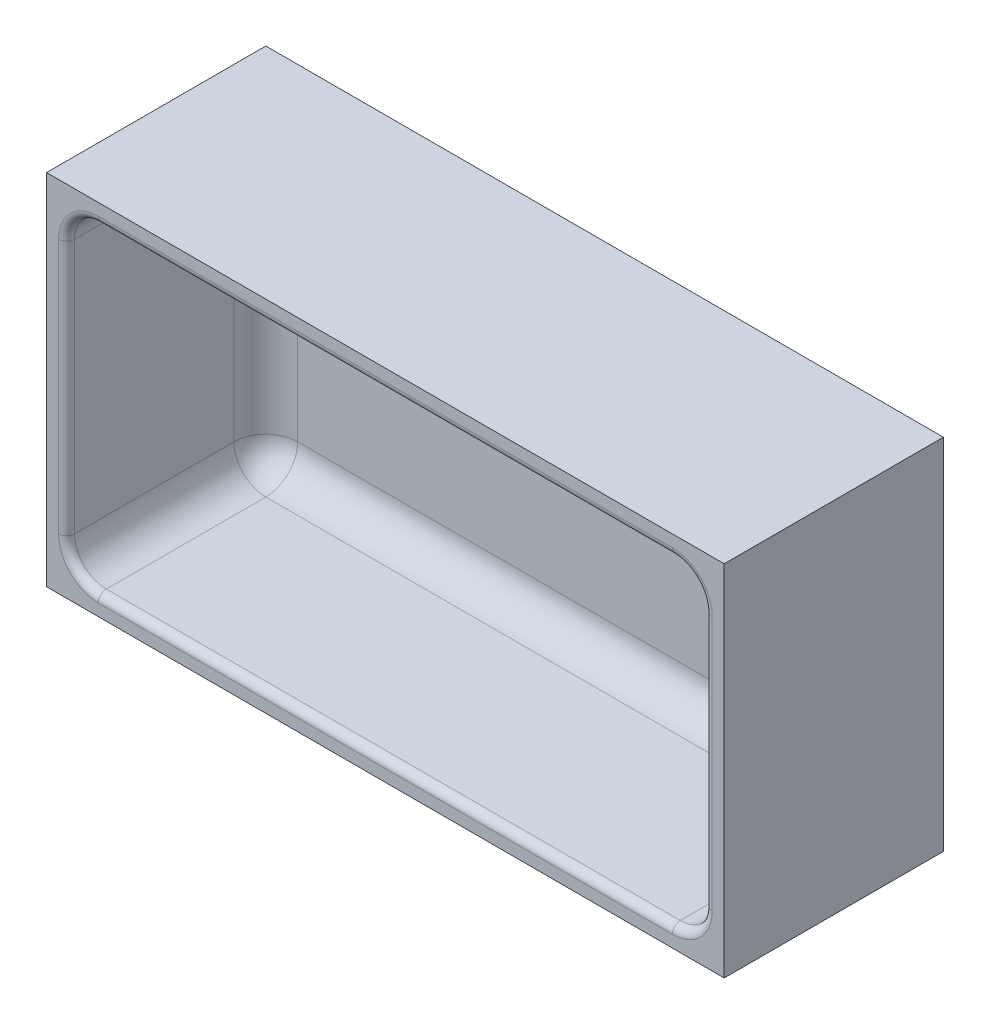
ISO-10303-21;
HEADER;
FILE_DESCRIPTION(('STEP AP214'),'2;1');
FILE_NAME('part.step','',(''),(''),'','','');
FILE_SCHEMA(('AUTOMOTIVE_DESIGN { 1 0 10303 214 1 1 1 1 }'));
ENDSEC;
DATA;
#1=APPLICATION_CONTEXT('core data for automotive mechanical design processes');
#2=APPLICATION_PROTOCOL_DEFINITION('international standard','automotive_design',2000,#1);
#3=PRODUCT_CONTEXT('',#1,'mechanical');
#4=PRODUCT('Part','Part','',(#3));
#5=PRODUCT_RELATED_PRODUCT_CATEGORY('part','',(#4));
#6=PRODUCT_DEFINITION_FORMATION('','',#4);
#7=PRODUCT_DEFINITION_CONTEXT('part definition',#1,'design');
#8=PRODUCT_DEFINITION('design','',#6,#7);
#9=PRODUCT_DEFINITION_SHAPE('','',#8);
#10=(LENGTH_UNIT() NAMED_UNIT(*) SI_UNIT(.MILLI.,.METRE.));
#11=(NAMED_UNIT(*) PLANE_ANGLE_UNIT() SI_UNIT($,.RADIAN.));
#12=(NAMED_UNIT(*) SI_UNIT($,.STERADIAN.) SOLID_ANGLE_UNIT());
#13=UNCERTAINTY_MEASURE_WITH_UNIT(LENGTH_MEASURE(1.E-05),#10,'distance_accuracy_value','');
#14=(GEOMETRIC_REPRESENTATION_CONTEXT(3) GLOBAL_UNCERTAINTY_ASSIGNED_CONTEXT((#13)) GLOBAL_UNIT_ASSIGNED_CONTEXT((#10,
#11,#12)) REPRESENTATION_CONTEXT('',''));
#15=CARTESIAN_POINT('',(0.,0.,0.));
#16=DIRECTION('',(0.,0.,1.));
#17=DIRECTION('',(1.,0.,0.));
#18=AXIS2_PLACEMENT_3D('',#15,#16,#17);
#19=CARTESIAN_POINT('',(0.,0.,5.));
#20=DIRECTION('',(0.,0.,-1.));
#21=DIRECTION('',(-1.,0.,0.));
#22=AXIS2_PLACEMENT_3D('',#19,#20,#21);
#23=PLANE('',#22);
#24=DIRECTION('',(-1.,0.,0.));
#25=VECTOR('',#24,1.);
#26=CARTESIAN_POINT('',(0.,13.,5.));
#27=LINE('',#26,#25);
#28=CARTESIAN_POINT('',(-157.,13.,5.));
#29=VERTEX_POINT('',#28);
#30=CARTESIAN_POINT('',(-13.,13.,5.));
#31=VERTEX_POINT('',#30);
#32=EDGE_CURVE('E225',#29,#31,#27,.F.);
#33=ORIENTED_EDGE('',*,*,#32,.T.);
#34=DIRECTION('',(0.,1.,0.));
#35=VECTOR('',#34,1.);
#36=CARTESIAN_POINT('',(-13.,0.,5.));
#37=LINE('',#36,#35);
#38=CARTESIAN_POINT('',(-13.,77.,5.));
#39=VERTEX_POINT('',#38);
#40=EDGE_CURVE('E227',#31,#39,#37,.T.);
#41=ORIENTED_EDGE('',*,*,#40,.T.);
#42=DIRECTION('',(1.,0.,0.));
#43=VECTOR('',#42,1.);
#44=CARTESIAN_POINT('',(0.,77.,5.));
#45=LINE('',#44,#43);
#46=CARTESIAN_POINT('',(-157.,77.,5.));
#47=VERTEX_POINT('',#46);
#48=EDGE_CURVE('E223',#39,#47,#45,.F.);
#49=ORIENTED_EDGE('',*,*,#48,.T.);
#50=DIRECTION('',(0.,1.,0.));
#51=VECTOR('',#50,1.);
#52=CARTESIAN_POINT('',(-157.,0.,5.));
#53=LINE('',#52,#51);
#54=EDGE_CURVE('E221',#47,#29,#53,.F.);
#55=ORIENTED_EDGE('',*,*,#54,.T.);
#56=EDGE_LOOP('',(#33,#41,#49,#55));
#57=FACE_BOUND('',#56,.T.);
#58=ADVANCED_FACE('F39',(#57),#23,.F.);
#59=CARTESIAN_POINT('',(-5.,5.,55.));
#60=DIRECTION('',(-1.,0.,0.));
#61=DIRECTION('',(0.,0.,1.));
#62=AXIS2_PLACEMENT_3D('',#59,#60,#61);
#63=PLANE('',#62);
#64=DIRECTION('',(0.,0.,-1.));
#65=VECTOR('',#64,1.);
#66=CARTESIAN_POINT('',(-5.,13.,55.));
#67=LINE('',#66,#65);
#68=CARTESIAN_POINT('',(-5.,13.,13.));
#69=VERTEX_POINT('',#68);
#70=CARTESIAN_POINT('',(-5.,13.,53.));
#71=VERTEX_POINT('',#70);
#72=EDGE_CURVE('E205',#69,#71,#67,.F.);
#73=ORIENTED_EDGE('',*,*,#72,.T.);
#74=DIRECTION('',(0.,1.,0.));
#75=VECTOR('',#74,1.);
#76=CARTESIAN_POINT('',(-5.,77.,53.));
#77=LINE('',#76,#75);
#78=CARTESIAN_POINT('',(-5.,77.,53.));
#79=VERTEX_POINT('',#78);
#80=EDGE_CURVE('E289',#71,#79,#77,.T.);
#81=ORIENTED_EDGE('',*,*,#80,.T.);
#82=DIRECTION('',(0.,0.,-1.));
#83=VECTOR('',#82,1.);
#84=CARTESIAN_POINT('',(-5.,77.,5.));
#85=LINE('',#84,#83);
#86=CARTESIAN_POINT('',(-5.,77.,13.));
#87=VERTEX_POINT('',#86);
#88=EDGE_CURVE('E203',#79,#87,#85,.T.);
#89=ORIENTED_EDGE('',*,*,#88,.T.);
#90=DIRECTION('',(0.,1.,0.));
#91=VECTOR('',#90,1.);
#92=CARTESIAN_POINT('',(-5.,5.,13.));
#93=LINE('',#92,#91);
#94=EDGE_CURVE('E201',#87,#69,#93,.F.);
#95=ORIENTED_EDGE('',*,*,#94,.T.);
#96=EDGE_LOOP('',(#73,#81,#89,#95));
#97=FACE_BOUND('',#96,.T.);
#98=ADVANCED_FACE('F333',(#97),#63,.T.);
#99=CARTESIAN_POINT('',(-165.,85.,55.));
#100=DIRECTION('',(0.,-1.,0.));
#101=DIRECTION('',(0.,0.,-1.));
#102=AXIS2_PLACEMENT_3D('',#99,#100,#101);
#103=PLANE('',#102);
#104=DIRECTION('',(0.,0.,-1.));
#105=VECTOR('',#104,1.);
#106=CARTESIAN_POINT('',(-13.,85.,55.));
#107=LINE('',#106,#105);
#108=CARTESIAN_POINT('',(-13.,85.,13.));
#109=VERTEX_POINT('',#108);
#110=CARTESIAN_POINT('',(-13.,85.,53.));
#111=VERTEX_POINT('',#110);
#112=EDGE_CURVE('E212',#109,#111,#107,.F.);
#113=ORIENTED_EDGE('',*,*,#112,.T.);
#114=DIRECTION('',(-1.,0.,0.));
#115=VECTOR('',#114,1.);
#116=CARTESIAN_POINT('',(-157.,85.,53.));
#117=LINE('',#116,#115);
#118=CARTESIAN_POINT('',(-157.,85.,53.));
#119=VERTEX_POINT('',#118);
#120=EDGE_CURVE('E285',#111,#119,#117,.T.);
#121=ORIENTED_EDGE('',*,*,#120,.T.);
#122=DIRECTION('',(0.,0.,-1.));
#123=VECTOR('',#122,1.);
#124=CARTESIAN_POINT('',(-157.,85.,5.));
#125=LINE('',#124,#123);
#126=CARTESIAN_POINT('',(-157.,85.,13.));
#127=VERTEX_POINT('',#126);
#128=EDGE_CURVE('E210',#119,#127,#125,.T.);
#129=ORIENTED_EDGE('',*,*,#128,.T.);
#130=DIRECTION('',(1.,0.,0.));
#131=VECTOR('',#130,1.);
#132=CARTESIAN_POINT('',(-165.,85.,13.));
#133=LINE('',#132,#131);
#134=EDGE_CURVE('E208',#127,#109,#133,.T.);
#135=ORIENTED_EDGE('',*,*,#134,.T.);
#136=EDGE_LOOP('',(#113,#121,#129,#135));
#137=FACE_BOUND('',#136,.T.);
#138=ADVANCED_FACE('F378',(#137),#103,.T.);
#139=CARTESIAN_POINT('',(-165.,5.,55.));
#140=DIRECTION('',(1.,0.,0.));
#141=DIRECTION('',(0.,0.,-1.));
#142=AXIS2_PLACEMENT_3D('',#139,#140,#141);
#143=PLANE('',#142);
#144=DIRECTION('',(0.,0.,-1.));
#145=VECTOR('',#144,1.);
#146=CARTESIAN_POINT('',(-165.,77.,55.));
#147=LINE('',#146,#145);
#148=CARTESIAN_POINT('',(-165.,77.,13.));
#149=VERTEX_POINT('',#148);
#150=CARTESIAN_POINT('',(-165.,77.,53.));
#151=VERTEX_POINT('',#150);
#152=EDGE_CURVE('E219',#149,#151,#147,.F.);
#153=ORIENTED_EDGE('',*,*,#152,.T.);
#154=DIRECTION('',(0.,-1.,0.));
#155=VECTOR('',#154,1.);
#156=CARTESIAN_POINT('',(-165.,13.,53.));
#157=LINE('',#156,#155);
#158=CARTESIAN_POINT('',(-165.,13.,53.));
#159=VERTEX_POINT('',#158);
#160=EDGE_CURVE('E11',#151,#159,#157,.T.);
#161=ORIENTED_EDGE('',*,*,#160,.T.);
#162=DIRECTION('',(0.,0.,-1.));
#163=VECTOR('',#162,1.);
#164=CARTESIAN_POINT('',(-165.,13.,5.));
#165=LINE('',#164,#163);
#166=CARTESIAN_POINT('',(-165.,13.,13.));
#167=VERTEX_POINT('',#166);
#168=EDGE_CURVE('E217',#159,#167,#165,.T.);
#169=ORIENTED_EDGE('',*,*,#168,.T.);
#170=DIRECTION('',(0.,1.,0.));
#171=VECTOR('',#170,1.);
#172=CARTESIAN_POINT('',(-165.,5.,13.));
#173=LINE('',#172,#171);
#174=EDGE_CURVE('E215',#167,#149,#173,.T.);
#175=ORIENTED_EDGE('',*,*,#174,.T.);
#176=EDGE_LOOP('',(#153,#161,#169,#175));
#177=FACE_BOUND('',#176,.T.);
#178=ADVANCED_FACE('F362',(#177),#143,.T.);
#179=CARTESIAN_POINT('',(-5.,5.,55.));
#180=DIRECTION('',(0.,1.,0.));
#181=DIRECTION('',(0.,0.,1.));
#182=AXIS2_PLACEMENT_3D('',#179,#180,#181);
#183=PLANE('',#182);
#184=DIRECTION('',(0.,0.,-1.));
#185=VECTOR('',#184,1.);
#186=CARTESIAN_POINT('',(-157.,5.,55.));
#187=LINE('',#186,#185);
#188=CARTESIAN_POINT('',(-157.,5.,13.));
#189=VERTEX_POINT('',#188);
#190=CARTESIAN_POINT('',(-157.,5.,53.));
#191=VERTEX_POINT('',#190);
#192=EDGE_CURVE('E192',#189,#191,#187,.F.);
#193=ORIENTED_EDGE('',*,*,#192,.T.);
#194=DIRECTION('',(1.,0.,0.));
#195=VECTOR('',#194,1.);
#196=CARTESIAN_POINT('',(-13.,5.,53.));
#197=LINE('',#196,#195);
#198=CARTESIAN_POINT('',(-13.,5.,53.));
#199=VERTEX_POINT('',#198);
#200=EDGE_CURVE('E293',#191,#199,#197,.T.);
#201=ORIENTED_EDGE('',*,*,#200,.T.);
#202=DIRECTION('',(0.,0.,-1.));
#203=VECTOR('',#202,1.);
#204=CARTESIAN_POINT('',(-13.,5.,5.));
#205=LINE('',#204,#203);
#206=CARTESIAN_POINT('',(-13.,5.,13.));
#207=VERTEX_POINT('',#206);
#208=EDGE_CURVE('E199',#199,#207,#205,.T.);
#209=ORIENTED_EDGE('',*,*,#208,.T.);
#210=DIRECTION('',(-1.,0.,0.));
#211=VECTOR('',#210,1.);
#212=CARTESIAN_POINT('',(-5.,5.,13.));
#213=LINE('',#212,#211);
#214=EDGE_CURVE('E190',#207,#189,#213,.T.);
#215=ORIENTED_EDGE('',*,*,#214,.T.);
#216=EDGE_LOOP('',(#193,#201,#209,#215));
#217=FACE_BOUND('',#216,.T.);
#218=ADVANCED_FACE('F350',(#217),#183,.T.);
#219=CARTESIAN_POINT('',(0.,0.,55.));
#220=DIRECTION('',(0.,0.,-1.));
#221=DIRECTION('',(-1.,0.,0.));
#222=AXIS2_PLACEMENT_3D('',#219,#220,#221);
#223=PLANE('',#222);
#224=DIRECTION('',(0.,-1.,0.));
#225=VECTOR('',#224,1.);
#226=CARTESIAN_POINT('',(-167.,77.,55.));
#227=LINE('',#226,#225);
#228=CARTESIAN_POINT('',(-167.,13.,55.));
#229=VERTEX_POINT('',#228);
#230=CARTESIAN_POINT('',(-167.,77.,55.));
#231=VERTEX_POINT('',#230);
#232=EDGE_CURVE('E230',#229,#231,#227,.F.);
#233=ORIENTED_EDGE('',*,*,#232,.T.);
#234=CARTESIAN_POINT('',(-157.,77.,55.));
#235=DIRECTION('',(0.,0.,-1.));
#236=DIRECTION('',(-1.,0.,0.));
#237=AXIS2_PLACEMENT_3D('',#234,#235,#236);
#238=CIRCLE('',#237,10.);
#239=CARTESIAN_POINT('',(-157.,87.,55.));
#240=VERTEX_POINT('',#239);
#241=EDGE_CURVE('E279',#231,#240,#238,.T.);
#242=ORIENTED_EDGE('',*,*,#241,.T.);
#243=DIRECTION('',(-1.,0.,0.));
#244=VECTOR('',#243,1.);
#245=CARTESIAN_POINT('',(-13.,87.,55.));
#246=LINE('',#245,#244);
#247=CARTESIAN_POINT('',(-13.,87.,55.));
#248=VERTEX_POINT('',#247);
#249=EDGE_CURVE('E277',#240,#248,#246,.F.);
#250=ORIENTED_EDGE('',*,*,#249,.T.);
#251=CARTESIAN_POINT('',(-13.,77.,55.));
#252=DIRECTION('',(0.,0.,-1.));
#253=DIRECTION('',(-1.,0.,0.));
#254=AXIS2_PLACEMENT_3D('',#251,#252,#253);
#255=CIRCLE('',#254,10.);
#256=CARTESIAN_POINT('',(-3.,77.,55.));
#257=VERTEX_POINT('',#256);
#258=EDGE_CURVE('E275',#248,#257,#255,.T.);
#259=ORIENTED_EDGE('',*,*,#258,.T.);
#260=DIRECTION('',(0.,1.,0.));
#261=VECTOR('',#260,1.);
#262=CARTESIAN_POINT('',(-3.,13.,55.));
#263=LINE('',#262,#261);
#264=CARTESIAN_POINT('',(-3.,13.,55.));
#265=VERTEX_POINT('',#264);
#266=EDGE_CURVE('E273',#257,#265,#263,.F.);
#267=ORIENTED_EDGE('',*,*,#266,.T.);
#268=CARTESIAN_POINT('',(-13.,13.,55.));
#269=DIRECTION('',(0.,0.,-1.));
#270=DIRECTION('',(-1.,0.,0.));
#271=AXIS2_PLACEMENT_3D('',#268,#269,#270);
#272=CIRCLE('',#271,10.);
#273=CARTESIAN_POINT('',(-13.,3.,55.));
#274=VERTEX_POINT('',#273);
#275=EDGE_CURVE('E271',#265,#274,#272,.T.);
#276=ORIENTED_EDGE('',*,*,#275,.T.);
#277=DIRECTION('',(1.,0.,0.));
#278=VECTOR('',#277,1.);
#279=CARTESIAN_POINT('',(-157.,3.,55.));
#280=LINE('',#279,#278);
#281=CARTESIAN_POINT('',(-157.,3.,55.));
#282=VERTEX_POINT('',#281);
#283=EDGE_CURVE('E269',#274,#282,#280,.F.);
#284=ORIENTED_EDGE('',*,*,#283,.T.);
#285=CARTESIAN_POINT('',(-157.,13.,55.));
#286=DIRECTION('',(0.,0.,-1.));
#287=DIRECTION('',(-1.,0.,0.));
#288=AXIS2_PLACEMENT_3D('',#285,#286,#287);
#289=CIRCLE('',#288,10.);
#290=EDGE_CURVE('E267',#282,#229,#289,.T.);
#291=ORIENTED_EDGE('',*,*,#290,.T.);
#292=EDGE_LOOP('',(#233,#242,#250,#259,#267,#276,#284,#291));
#293=FACE_BOUND('',#292,.T.);
#294=DIRECTION('',(1.,0.,0.));
#295=VECTOR('',#294,1.);
#296=CARTESIAN_POINT('',(0.,0.,55.));
#297=LINE('',#296,#295);
#298=CARTESIAN_POINT('',(-170.,0.,55.));
#299=VERTEX_POINT('',#298);
#300=CARTESIAN_POINT('',(0.,0.,55.));
#301=VERTEX_POINT('',#300);
#302=EDGE_CURVE('E176',#299,#301,#297,.T.);
#303=ORIENTED_EDGE('',*,*,#302,.T.);
#304=DIRECTION('',(0.,1.,0.));
#305=VECTOR('',#304,1.);
#306=CARTESIAN_POINT('',(0.,0.,55.));
#307=LINE('',#306,#305);
#308=CARTESIAN_POINT('',(0.,90.,55.));
#309=VERTEX_POINT('',#308);
#310=EDGE_CURVE('E165',#301,#309,#307,.T.);
#311=ORIENTED_EDGE('',*,*,#310,.T.);
#312=DIRECTION('',(-1.,0.,0.));
#313=VECTOR('',#312,1.);
#314=CARTESIAN_POINT('',(-170.,90.,55.));
#315=LINE('',#314,#313);
#316=CARTESIAN_POINT('',(-170.,90.,55.));
#317=VERTEX_POINT('',#316);
#318=EDGE_CURVE('E175',#309,#317,#315,.T.);
#319=ORIENTED_EDGE('',*,*,#318,.T.);
#320=DIRECTION('',(0.,-1.,0.));
#321=VECTOR('',#320,1.);
#322=CARTESIAN_POINT('',(-170.,0.,55.));
#323=LINE('',#322,#321);
#324=EDGE_CURVE('E181',#317,#299,#323,.T.);
#325=ORIENTED_EDGE('',*,*,#324,.T.);
#326=EDGE_LOOP('',(#303,#311,#319,#325));
#327=FACE_BOUND('',#326,.T.);
#328=ADVANCED_FACE('F179',(#293,#327),#223,.F.);
#329=CARTESIAN_POINT('',(0.,0.,55.));
#330=DIRECTION('',(0.,1.,0.));
#331=DIRECTION('',(0.,0.,1.));
#332=AXIS2_PLACEMENT_3D('',#329,#330,#331);
#333=PLANE('',#332);
#334=DIRECTION('',(1.,0.,0.));
#335=VECTOR('',#334,1.);
#336=CARTESIAN_POINT('',(0.,0.,0.));
#337=LINE('',#336,#335);
#338=CARTESIAN_POINT('',(-170.,0.,0.));
#339=VERTEX_POINT('',#338);
#340=CARTESIAN_POINT('',(0.,0.,0.));
#341=VERTEX_POINT('',#340);
#342=EDGE_CURVE('E189',#339,#341,#337,.T.);
#343=ORIENTED_EDGE('',*,*,#342,.T.);
#344=DIRECTION('',(0.,0.,-1.));
#345=VECTOR('',#344,1.);
#346=CARTESIAN_POINT('',(0.,0.,55.));
#347=LINE('',#346,#345);
#348=EDGE_CURVE('E169',#301,#341,#347,.T.);
#349=ORIENTED_EDGE('',*,*,#348,.F.);
#350=ORIENTED_EDGE('',*,*,#302,.F.);
#351=DIRECTION('',(0.,0.,-1.));
#352=VECTOR('',#351,1.);
#353=CARTESIAN_POINT('',(-170.,0.,55.));
#354=LINE('',#353,#352);
#355=EDGE_CURVE('E671',#299,#339,#354,.T.);
#356=ORIENTED_EDGE('',*,*,#355,.T.);
#357=EDGE_LOOP('',(#343,#349,#350,#356));
#358=FACE_BOUND('',#357,.T.);
#359=ADVANCED_FACE('F187',(#358),#333,.F.);
#360=CARTESIAN_POINT('',(0.,0.,55.));
#361=DIRECTION('',(-1.,0.,0.));
#362=DIRECTION('',(0.,0.,1.));
#363=AXIS2_PLACEMENT_3D('',#360,#361,#362);
#364=PLANE('',#363);
#365=DIRECTION('',(0.,1.,0.));
#366=VECTOR('',#365,1.);
#367=CARTESIAN_POINT('',(0.,0.,0.));
#368=LINE('',#367,#366);
#369=CARTESIAN_POINT('',(0.,90.,0.));
#370=VERTEX_POINT('',#369);
#371=EDGE_CURVE('E669',#341,#370,#368,.T.);
#372=ORIENTED_EDGE('',*,*,#371,.T.);
#373=DIRECTION('',(0.,0.,-1.));
#374=VECTOR('',#373,1.);
#375=CARTESIAN_POINT('',(0.,90.,55.));
#376=LINE('',#375,#374);
#377=EDGE_CURVE('E172',#309,#370,#376,.T.);
#378=ORIENTED_EDGE('',*,*,#377,.F.);
#379=ORIENTED_EDGE('',*,*,#310,.F.);
#380=ORIENTED_EDGE('',*,*,#348,.T.);
#381=EDGE_LOOP('',(#372,#378,#379,#380));
#382=FACE_BOUND('',#381,.T.);
#383=ADVANCED_FACE('F167',(#382),#364,.F.);
#384=CARTESIAN_POINT('',(-170.,90.,55.));
#385=DIRECTION('',(0.,-1.,0.));
#386=DIRECTION('',(0.,0.,-1.));
#387=AXIS2_PLACEMENT_3D('',#384,#385,#386);
#388=PLANE('',#387);
#389=DIRECTION('',(-1.,0.,0.));
#390=VECTOR('',#389,1.);
#391=CARTESIAN_POINT('',(-170.,90.,0.));
#392=LINE('',#391,#390);
#393=CARTESIAN_POINT('',(-170.,90.,0.));
#394=VERTEX_POINT('',#393);
#395=EDGE_CURVE('E666',#370,#394,#392,.T.);
#396=ORIENTED_EDGE('',*,*,#395,.T.);
#397=DIRECTION('',(0.,0.,-1.));
#398=VECTOR('',#397,1.);
#399=CARTESIAN_POINT('',(-170.,90.,55.));
#400=LINE('',#399,#398);
#401=EDGE_CURVE('E194',#317,#394,#400,.T.);
#402=ORIENTED_EDGE('',*,*,#401,.F.);
#403=ORIENTED_EDGE('',*,*,#318,.F.);
#404=ORIENTED_EDGE('',*,*,#377,.T.);
#405=EDGE_LOOP('',(#396,#402,#403,#404));
#406=FACE_BOUND('',#405,.T.);
#407=ADVANCED_FACE('F572',(#406),#388,.F.);
#408=CARTESIAN_POINT('',(-170.,0.,55.));
#409=DIRECTION('',(1.,0.,0.));
#410=DIRECTION('',(0.,0.,-1.));
#411=AXIS2_PLACEMENT_3D('',#408,#409,#410);
#412=PLANE('',#411);
#413=DIRECTION('',(0.,-1.,0.));
#414=VECTOR('',#413,1.);
#415=CARTESIAN_POINT('',(-170.,0.,0.));
#416=LINE('',#415,#414);
#417=EDGE_CURVE('E185',#394,#339,#416,.T.);
#418=ORIENTED_EDGE('',*,*,#417,.T.);
#419=ORIENTED_EDGE('',*,*,#355,.F.);
#420=ORIENTED_EDGE('',*,*,#324,.F.);
#421=ORIENTED_EDGE('',*,*,#401,.T.);
#422=EDGE_LOOP('',(#418,#419,#420,#421));
#423=FACE_BOUND('',#422,.T.);
#424=ADVANCED_FACE('F427',(#423),#412,.F.);
#425=CARTESIAN_POINT('',(0.,0.,0.));
#426=DIRECTION('',(0.,0.,-1.));
#427=DIRECTION('',(-1.,0.,0.));
#428=AXIS2_PLACEMENT_3D('',#425,#426,#427);
#429=PLANE('',#428);
#430=ORIENTED_EDGE('',*,*,#342,.F.);
#431=ORIENTED_EDGE('',*,*,#417,.F.);
#432=ORIENTED_EDGE('',*,*,#395,.F.);
#433=ORIENTED_EDGE('',*,*,#371,.F.);
#434=EDGE_LOOP('',(#430,#431,#432,#433));
#435=FACE_BOUND('',#434,.T.);
#436=ADVANCED_FACE('F425',(#435),#429,.T.);
#437=CARTESIAN_POINT('',(-157.,77.,55.));
#438=DIRECTION('',(0.,0.,1.));
#439=DIRECTION('',(1.,0.,0.));
#440=AXIS2_PLACEMENT_3D('',#437,#438,#439);
#441=CYLINDRICAL_SURFACE('',#440,8.);
#442=ORIENTED_EDGE('',*,*,#128,.F.);
#443=CARTESIAN_POINT('',(-157.,77.,53.));
#444=DIRECTION('',(0.,0.,-1.));
#445=DIRECTION('',(-1.,0.,0.));
#446=AXIS2_PLACEMENT_3D('',#443,#444,#445);
#447=CIRCLE('',#446,8.);
#448=EDGE_CURVE('E282',#119,#151,#447,.F.);
#449=ORIENTED_EDGE('',*,*,#448,.T.);
#450=ORIENTED_EDGE('',*,*,#152,.F.);
#451=CARTESIAN_POINT('',(-157.,77.,13.));
#452=DIRECTION('',(0.,0.,1.));
#453=DIRECTION('',(1.,0.,0.));
#454=AXIS2_PLACEMENT_3D('',#451,#452,#453);
#455=CIRCLE('',#454,8.);
#456=EDGE_CURVE('E263',#127,#149,#455,.T.);
#457=ORIENTED_EDGE('',*,*,#456,.F.);
#458=EDGE_LOOP('',(#442,#449,#450,#457));
#459=FACE_BOUND('',#458,.T.);
#460=ADVANCED_FACE('F366',(#459),#441,.F.);
#461=CARTESIAN_POINT('',(-157.,77.,13.));
#462=DIRECTION('',(-1.,0.,0.));
#463=DIRECTION('',(0.,0.,1.));
#464=AXIS2_PLACEMENT_3D('',#461,#462,#463);
#465=SPHERICAL_SURFACE('',#464,8.);
#466=CARTESIAN_POINT('',(-157.,77.,13.));
#467=DIRECTION('',(1.,0.,0.));
#468=DIRECTION('',(0.,0.,-1.));
#469=AXIS2_PLACEMENT_3D('',#466,#467,#468);
#470=CIRCLE('',#469,8.);
#471=EDGE_CURVE('E257',#127,#47,#470,.F.);
#472=ORIENTED_EDGE('',*,*,#471,.F.);
#473=ORIENTED_EDGE('',*,*,#456,.T.);
#474=CARTESIAN_POINT('',(-157.,77.,13.));
#475=DIRECTION('',(0.,-1.,0.));
#476=DIRECTION('',(0.,0.,-1.));
#477=AXIS2_PLACEMENT_3D('',#474,#475,#476);
#478=CIRCLE('',#477,8.);
#479=EDGE_CURVE('E260',#47,#149,#478,.F.);
#480=ORIENTED_EDGE('',*,*,#479,.F.);
#481=EDGE_LOOP('',(#472,#473,#480));
#482=FACE_BOUND('',#481,.T.);
#483=ADVANCED_FACE('F370',(#482),#465,.F.);
#484=CARTESIAN_POINT('',(-157.,13.,55.));
#485=DIRECTION('',(0.,0.,1.));
#486=DIRECTION('',(1.,0.,0.));
#487=AXIS2_PLACEMENT_3D('',#484,#485,#486);
#488=CYLINDRICAL_SURFACE('',#487,8.);
#489=ORIENTED_EDGE('',*,*,#168,.F.);
#490=CARTESIAN_POINT('',(-157.,13.,53.));
#491=DIRECTION('',(0.,0.,-1.));
#492=DIRECTION('',(-1.,0.,0.));
#493=AXIS2_PLACEMENT_3D('',#490,#491,#492);
#494=CIRCLE('',#493,8.);
#495=EDGE_CURVE('E48',#159,#191,#494,.F.);
#496=ORIENTED_EDGE('',*,*,#495,.T.);
#497=ORIENTED_EDGE('',*,*,#192,.F.);
#498=CARTESIAN_POINT('',(-157.,13.,13.));
#499=DIRECTION('',(0.,0.,1.));
#500=DIRECTION('',(1.,0.,0.));
#501=AXIS2_PLACEMENT_3D('',#498,#499,#500);
#502=CIRCLE('',#501,8.);
#503=EDGE_CURVE('E254',#167,#189,#502,.T.);
#504=ORIENTED_EDGE('',*,*,#503,.F.);
#505=EDGE_LOOP('',(#489,#496,#497,#504));
#506=FACE_BOUND('',#505,.T.);
#507=ADVANCED_FACE('F352',(#506),#488,.F.);
#508=CARTESIAN_POINT('',(-157.,5.,13.));
#509=DIRECTION('',(0.,1.,0.));
#510=DIRECTION('',(0.,0.,1.));
#511=AXIS2_PLACEMENT_3D('',#508,#509,#510);
#512=CYLINDRICAL_SURFACE('',#511,8.);
#513=ORIENTED_EDGE('',*,*,#479,.T.);
#514=ORIENTED_EDGE('',*,*,#174,.F.);
#515=CARTESIAN_POINT('',(-157.,13.,13.));
#516=DIRECTION('',(0.,1.,0.));
#517=DIRECTION('',(0.,0.,1.));
#518=AXIS2_PLACEMENT_3D('',#515,#516,#517);
#519=CIRCLE('',#518,8.);
#520=EDGE_CURVE('E251',#29,#167,#519,.T.);
#521=ORIENTED_EDGE('',*,*,#520,.F.);
#522=ORIENTED_EDGE('',*,*,#54,.F.);
#523=EDGE_LOOP('',(#513,#514,#521,#522));
#524=FACE_BOUND('',#523,.T.);
#525=ADVANCED_FACE('F359',(#524),#512,.F.);
#526=CARTESIAN_POINT('',(-165.,77.,13.));
#527=DIRECTION('',(1.,0.,0.));
#528=DIRECTION('',(0.,0.,-1.));
#529=AXIS2_PLACEMENT_3D('',#526,#527,#528);
#530=CYLINDRICAL_SURFACE('',#529,8.);
#531=ORIENTED_EDGE('',*,*,#471,.T.);
#532=ORIENTED_EDGE('',*,*,#48,.F.);
#533=CARTESIAN_POINT('',(-13.,77.,13.));
#534=DIRECTION('',(-1.,0.,0.));
#535=DIRECTION('',(0.,0.,1.));
#536=AXIS2_PLACEMENT_3D('',#533,#534,#535);
#537=CIRCLE('',#536,8.);
#538=EDGE_CURVE('E248',#109,#39,#537,.T.);
#539=ORIENTED_EDGE('',*,*,#538,.F.);
#540=ORIENTED_EDGE('',*,*,#134,.F.);
#541=EDGE_LOOP('',(#531,#532,#539,#540));
#542=FACE_BOUND('',#541,.T.);
#543=ADVANCED_FACE('F375',(#542),#530,.F.);
#544=CARTESIAN_POINT('',(-13.,77.,55.));
#545=DIRECTION('',(0.,0.,1.));
#546=DIRECTION('',(1.,0.,0.));
#547=AXIS2_PLACEMENT_3D('',#544,#545,#546);
#548=CYLINDRICAL_SURFACE('',#547,8.);
#549=ORIENTED_EDGE('',*,*,#88,.F.);
#550=CARTESIAN_POINT('',(-13.,77.,53.));
#551=DIRECTION('',(0.,0.,-1.));
#552=DIRECTION('',(-1.,0.,0.));
#553=AXIS2_PLACEMENT_3D('',#550,#551,#552);
#554=CIRCLE('',#553,8.);
#555=EDGE_CURVE('E287',#79,#111,#554,.F.);
#556=ORIENTED_EDGE('',*,*,#555,.T.);
#557=ORIENTED_EDGE('',*,*,#112,.F.);
#558=CARTESIAN_POINT('',(-13.,77.,13.));
#559=DIRECTION('',(0.,0.,1.));
#560=DIRECTION('',(0.,-1.,0.));
#561=AXIS2_PLACEMENT_3D('',#558,#559,#560);
#562=CIRCLE('',#561,8.);
#563=EDGE_CURVE('E245',#87,#109,#562,.T.);
#564=ORIENTED_EDGE('',*,*,#563,.F.);
#565=EDGE_LOOP('',(#549,#556,#557,#564));
#566=FACE_BOUND('',#565,.T.);
#567=ADVANCED_FACE('F381',(#566),#548,.F.);
#568=CARTESIAN_POINT('',(-157.,13.,13.));
#569=DIRECTION('',(-1.,0.,0.));
#570=DIRECTION('',(0.,0.,1.));
#571=AXIS2_PLACEMENT_3D('',#568,#569,#570);
#572=SPHERICAL_SURFACE('',#571,8.);
#573=ORIENTED_EDGE('',*,*,#520,.T.);
#574=ORIENTED_EDGE('',*,*,#503,.T.);
#575=CARTESIAN_POINT('',(-157.,13.,13.));
#576=DIRECTION('',(1.,0.,0.));
#577=DIRECTION('',(0.,0.,-1.));
#578=AXIS2_PLACEMENT_3D('',#575,#576,#577);
#579=CIRCLE('',#578,8.);
#580=EDGE_CURVE('E242',#29,#189,#579,.F.);
#581=ORIENTED_EDGE('',*,*,#580,.F.);
#582=EDGE_LOOP('',(#573,#574,#581));
#583=FACE_BOUND('',#582,.T.);
#584=ADVANCED_FACE('F354',(#583),#572,.F.);
#585=CARTESIAN_POINT('',(-13.,77.,13.));
#586=DIRECTION('',(0.,1.,0.));
#587=DIRECTION('',(0.,0.,1.));
#588=AXIS2_PLACEMENT_3D('',#585,#586,#587);
#589=SPHERICAL_SURFACE('',#588,8.);
#590=ORIENTED_EDGE('',*,*,#563,.T.);
#591=ORIENTED_EDGE('',*,*,#538,.T.);
#592=CARTESIAN_POINT('',(-13.,77.,13.));
#593=DIRECTION('',(0.,-1.,0.));
#594=DIRECTION('',(0.,0.,-1.));
#595=AXIS2_PLACEMENT_3D('',#592,#593,#594);
#596=CIRCLE('',#595,8.);
#597=EDGE_CURVE('E240',#87,#39,#596,.F.);
#598=ORIENTED_EDGE('',*,*,#597,.F.);
#599=EDGE_LOOP('',(#590,#591,#598));
#600=FACE_BOUND('',#599,.T.);
#601=ADVANCED_FACE('F437',(#600),#589,.F.);
#602=CARTESIAN_POINT('',(-5.,13.,13.));
#603=DIRECTION('',(-1.,0.,0.));
#604=DIRECTION('',(0.,0.,1.));
#605=AXIS2_PLACEMENT_3D('',#602,#603,#604);
#606=CYLINDRICAL_SURFACE('',#605,8.);
#607=ORIENTED_EDGE('',*,*,#580,.T.);
#608=ORIENTED_EDGE('',*,*,#214,.F.);
#609=CARTESIAN_POINT('',(-13.,13.,13.));
#610=DIRECTION('',(-1.,0.,0.));
#611=DIRECTION('',(0.,0.,1.));
#612=AXIS2_PLACEMENT_3D('',#609,#610,#611);
#613=CIRCLE('',#612,8.);
#614=EDGE_CURVE('E237',#31,#207,#613,.T.);
#615=ORIENTED_EDGE('',*,*,#614,.F.);
#616=ORIENTED_EDGE('',*,*,#32,.F.);
#617=EDGE_LOOP('',(#607,#608,#615,#616));
#618=FACE_BOUND('',#617,.T.);
#619=ADVANCED_FACE('F347',(#618),#606,.F.);
#620=CARTESIAN_POINT('',(-13.,0.,13.));
#621=DIRECTION('',(0.,1.,0.));
#622=DIRECTION('',(0.,0.,1.));
#623=AXIS2_PLACEMENT_3D('',#620,#621,#622);
#624=CYLINDRICAL_SURFACE('',#623,8.);
#625=ORIENTED_EDGE('',*,*,#597,.T.);
#626=ORIENTED_EDGE('',*,*,#40,.F.);
#627=CARTESIAN_POINT('',(-13.,13.,13.));
#628=DIRECTION('',(0.,1.,0.));
#629=DIRECTION('',(0.,0.,1.));
#630=AXIS2_PLACEMENT_3D('',#627,#628,#629);
#631=CIRCLE('',#630,8.);
#632=EDGE_CURVE('E234',#69,#31,#631,.T.);
#633=ORIENTED_EDGE('',*,*,#632,.F.);
#634=ORIENTED_EDGE('',*,*,#94,.F.);
#635=EDGE_LOOP('',(#625,#626,#633,#634));
#636=FACE_BOUND('',#635,.T.);
#637=ADVANCED_FACE('F340',(#636),#624,.F.);
#638=CARTESIAN_POINT('',(-13.,13.,13.));
#639=DIRECTION('',(0.,0.,-1.));
#640=DIRECTION('',(-1.,0.,0.));
#641=AXIS2_PLACEMENT_3D('',#638,#639,#640);
#642=SPHERICAL_SURFACE('',#641,8.);
#643=ORIENTED_EDGE('',*,*,#632,.T.);
#644=ORIENTED_EDGE('',*,*,#614,.T.);
#645=CARTESIAN_POINT('',(-13.,13.,13.));
#646=DIRECTION('',(0.,0.,1.));
#647=DIRECTION('',(1.,0.,0.));
#648=AXIS2_PLACEMENT_3D('',#645,#646,#647);
#649=CIRCLE('',#648,8.);
#650=EDGE_CURVE('E231',#69,#207,#649,.F.);
#651=ORIENTED_EDGE('',*,*,#650,.F.);
#652=EDGE_LOOP('',(#643,#644,#651));
#653=FACE_BOUND('',#652,.T.);
#654=ADVANCED_FACE('F343',(#653),#642,.F.);
#655=CARTESIAN_POINT('',(-13.,13.,55.));
#656=DIRECTION('',(0.,0.,1.));
#657=DIRECTION('',(1.,0.,0.));
#658=AXIS2_PLACEMENT_3D('',#655,#656,#657);
#659=CYLINDRICAL_SURFACE('',#658,8.);
#660=ORIENTED_EDGE('',*,*,#208,.F.);
#661=CARTESIAN_POINT('',(-13.,13.,53.));
#662=DIRECTION('',(0.,0.,-1.));
#663=DIRECTION('',(-1.,0.,0.));
#664=AXIS2_PLACEMENT_3D('',#661,#662,#663);
#665=CIRCLE('',#664,8.);
#666=EDGE_CURVE('E291',#199,#71,#665,.F.);
#667=ORIENTED_EDGE('',*,*,#666,.T.);
#668=ORIENTED_EDGE('',*,*,#72,.F.);
#669=ORIENTED_EDGE('',*,*,#650,.T.);
#670=EDGE_LOOP('',(#660,#667,#668,#669));
#671=FACE_BOUND('',#670,.T.);
#672=ADVANCED_FACE('F330',(#671),#659,.F.);
#673=CARTESIAN_POINT('',(-13.,13.,53.));
#674=DIRECTION('',(0.,0.,-1.));
#675=DIRECTION('',(-1.,0.,0.));
#676=AXIS2_PLACEMENT_3D('',#673,#674,#675);
#677=TOROIDAL_SURFACE('',#676,10.,2.);
#678=CARTESIAN_POINT('',(-3.,13.,53.));
#679=DIRECTION('',(0.,1.,0.));
#680=DIRECTION('',(0.,0.,1.));
#681=AXIS2_PLACEMENT_3D('',#678,#679,#680);
#682=CIRCLE('',#681,2.);
#683=EDGE_CURVE('E311',#71,#265,#682,.T.);
#684=ORIENTED_EDGE('',*,*,#683,.F.);
#685=ORIENTED_EDGE('',*,*,#666,.F.);
#686=CARTESIAN_POINT('',(-13.,3.,53.));
#687=DIRECTION('',(-1.,0.,0.));
#688=DIRECTION('',(0.,0.,1.));
#689=AXIS2_PLACEMENT_3D('',#686,#687,#688);
#690=CIRCLE('',#689,2.);
#691=EDGE_CURVE('E43',#274,#199,#690,.T.);
#692=ORIENTED_EDGE('',*,*,#691,.F.);
#693=ORIENTED_EDGE('',*,*,#275,.F.);
#694=EDGE_LOOP('',(#684,#685,#692,#693));
#695=FACE_BOUND('',#694,.T.);
#696=ADVANCED_FACE('F41',(#695),#677,.T.);
#697=CARTESIAN_POINT('',(-5.,3.,53.));
#698=DIRECTION('',(-1.,0.,0.));
#699=DIRECTION('',(0.,0.,1.));
#700=AXIS2_PLACEMENT_3D('',#697,#698,#699);
#701=CYLINDRICAL_SURFACE('',#700,2.);
#702=ORIENTED_EDGE('',*,*,#691,.T.);
#703=ORIENTED_EDGE('',*,*,#200,.F.);
#704=CARTESIAN_POINT('',(-157.,3.,53.));
#705=DIRECTION('',(-1.,0.,0.));
#706=DIRECTION('',(0.,0.,1.));
#707=AXIS2_PLACEMENT_3D('',#704,#705,#706);
#708=CIRCLE('',#707,2.);
#709=EDGE_CURVE('E309',#282,#191,#708,.T.);
#710=ORIENTED_EDGE('',*,*,#709,.F.);
#711=ORIENTED_EDGE('',*,*,#283,.F.);
#712=EDGE_LOOP('',(#702,#703,#710,#711));
#713=FACE_BOUND('',#712,.T.);
#714=ADVANCED_FACE('F322',(#713),#701,.T.);
#715=CARTESIAN_POINT('',(-3.,5.,53.));
#716=DIRECTION('',(0.,-1.,0.));
#717=DIRECTION('',(0.,0.,-1.));
#718=AXIS2_PLACEMENT_3D('',#715,#716,#717);
#719=CYLINDRICAL_SURFACE('',#718,2.);
#720=ORIENTED_EDGE('',*,*,#683,.T.);
#721=ORIENTED_EDGE('',*,*,#266,.F.);
#722=CARTESIAN_POINT('',(-3.,77.,53.));
#723=DIRECTION('',(0.,1.,0.));
#724=DIRECTION('',(0.,0.,1.));
#725=AXIS2_PLACEMENT_3D('',#722,#723,#724);
#726=CIRCLE('',#725,2.);
#727=EDGE_CURVE('E306',#79,#257,#726,.T.);
#728=ORIENTED_EDGE('',*,*,#727,.F.);
#729=ORIENTED_EDGE('',*,*,#80,.F.);
#730=EDGE_LOOP('',(#720,#721,#728,#729));
#731=FACE_BOUND('',#730,.T.);
#732=ADVANCED_FACE('F405',(#731),#719,.T.);
#733=CARTESIAN_POINT('',(-157.,13.,53.));
#734=DIRECTION('',(0.,0.,-1.));
#735=DIRECTION('',(-1.,0.,0.));
#736=AXIS2_PLACEMENT_3D('',#733,#734,#735);
#737=TOROIDAL_SURFACE('',#736,10.,2.);
#738=ORIENTED_EDGE('',*,*,#709,.T.);
#739=ORIENTED_EDGE('',*,*,#495,.F.);
#740=CARTESIAN_POINT('',(-167.,13.,53.));
#741=DIRECTION('',(0.,1.,0.));
#742=DIRECTION('',(0.,0.,1.));
#743=AXIS2_PLACEMENT_3D('',#740,#741,#742);
#744=CIRCLE('',#743,2.);
#745=EDGE_CURVE('E303',#229,#159,#744,.T.);
#746=ORIENTED_EDGE('',*,*,#745,.F.);
#747=ORIENTED_EDGE('',*,*,#290,.F.);
#748=EDGE_LOOP('',(#738,#739,#746,#747));
#749=FACE_BOUND('',#748,.T.);
#750=ADVANCED_FACE('F403',(#749),#737,.T.);
#751=CARTESIAN_POINT('',(-13.,77.,53.));
#752=DIRECTION('',(0.,0.,-1.));
#753=DIRECTION('',(-1.,0.,0.));
#754=AXIS2_PLACEMENT_3D('',#751,#752,#753);
#755=TOROIDAL_SURFACE('',#754,10.,2.);
#756=ORIENTED_EDGE('',*,*,#727,.T.);
#757=ORIENTED_EDGE('',*,*,#258,.F.);
#758=CARTESIAN_POINT('',(-13.,87.,53.));
#759=DIRECTION('',(-1.,0.,0.));
#760=DIRECTION('',(0.,0.,1.));
#761=AXIS2_PLACEMENT_3D('',#758,#759,#760);
#762=CIRCLE('',#761,2.);
#763=EDGE_CURVE('E300',#111,#248,#762,.T.);
#764=ORIENTED_EDGE('',*,*,#763,.F.);
#765=ORIENTED_EDGE('',*,*,#555,.F.);
#766=EDGE_LOOP('',(#756,#757,#764,#765));
#767=FACE_BOUND('',#766,.T.);
#768=ADVANCED_FACE('F386',(#767),#755,.T.);
#769=CARTESIAN_POINT('',(-167.,5.,53.));
#770=DIRECTION('',(0.,1.,0.));
#771=DIRECTION('',(0.,0.,1.));
#772=AXIS2_PLACEMENT_3D('',#769,#770,#771);
#773=CYLINDRICAL_SURFACE('',#772,2.);
#774=ORIENTED_EDGE('',*,*,#745,.T.);
#775=ORIENTED_EDGE('',*,*,#160,.F.);
#776=CARTESIAN_POINT('',(-167.,77.,53.));
#777=DIRECTION('',(0.,1.,0.));
#778=DIRECTION('',(0.,0.,1.));
#779=AXIS2_PLACEMENT_3D('',#776,#777,#778);
#780=CIRCLE('',#779,2.);
#781=EDGE_CURVE('E298',#231,#151,#780,.T.);
#782=ORIENTED_EDGE('',*,*,#781,.F.);
#783=ORIENTED_EDGE('',*,*,#232,.F.);
#784=EDGE_LOOP('',(#774,#775,#782,#783));
#785=FACE_BOUND('',#784,.T.);
#786=ADVANCED_FACE('F399',(#785),#773,.T.);
#787=CARTESIAN_POINT('',(-165.,87.,53.));
#788=DIRECTION('',(1.,0.,0.));
#789=DIRECTION('',(0.,0.,-1.));
#790=AXIS2_PLACEMENT_3D('',#787,#788,#789);
#791=CYLINDRICAL_SURFACE('',#790,2.);
#792=ORIENTED_EDGE('',*,*,#763,.T.);
#793=ORIENTED_EDGE('',*,*,#249,.F.);
#794=CARTESIAN_POINT('',(-157.,87.,53.));
#795=DIRECTION('',(-1.,0.,0.));
#796=DIRECTION('',(0.,0.,1.));
#797=AXIS2_PLACEMENT_3D('',#794,#795,#796);
#798=CIRCLE('',#797,2.);
#799=EDGE_CURVE('E296',#119,#240,#798,.T.);
#800=ORIENTED_EDGE('',*,*,#799,.F.);
#801=ORIENTED_EDGE('',*,*,#120,.F.);
#802=EDGE_LOOP('',(#792,#793,#800,#801));
#803=FACE_BOUND('',#802,.T.);
#804=ADVANCED_FACE('F392',(#803),#791,.T.);
#805=CARTESIAN_POINT('',(-157.,77.,53.));
#806=DIRECTION('',(0.,0.,-1.));
#807=DIRECTION('',(-1.,0.,0.));
#808=AXIS2_PLACEMENT_3D('',#805,#806,#807);
#809=TOROIDAL_SURFACE('',#808,10.,2.);
#810=ORIENTED_EDGE('',*,*,#781,.T.);
#811=ORIENTED_EDGE('',*,*,#448,.F.);
#812=ORIENTED_EDGE('',*,*,#799,.T.);
#813=ORIENTED_EDGE('',*,*,#241,.F.);
#814=EDGE_LOOP('',(#810,#811,#812,#813));
#815=FACE_BOUND('',#814,.T.);
#816=ADVANCED_FACE('F394',(#815),#809,.T.);
#817=CLOSED_SHELL('',(#58,#98,#138,#178,#218,#328,#359,#383,#407,#424,#436,#460,#483,#507,#525,
#543,#567,#584,#601,#619,#637,#654,#672,#696,#714,#732,#750,#768,#786,#804,#816));
#818=MANIFOLD_SOLID_BREP('B2',#817);
#819=ADVANCED_BREP_SHAPE_REPRESENTATION('',(#18,#818),#14);
#820=SHAPE_DEFINITION_REPRESENTATION(#9,#819);
ENDSEC;
END-ISO-10303-21;
